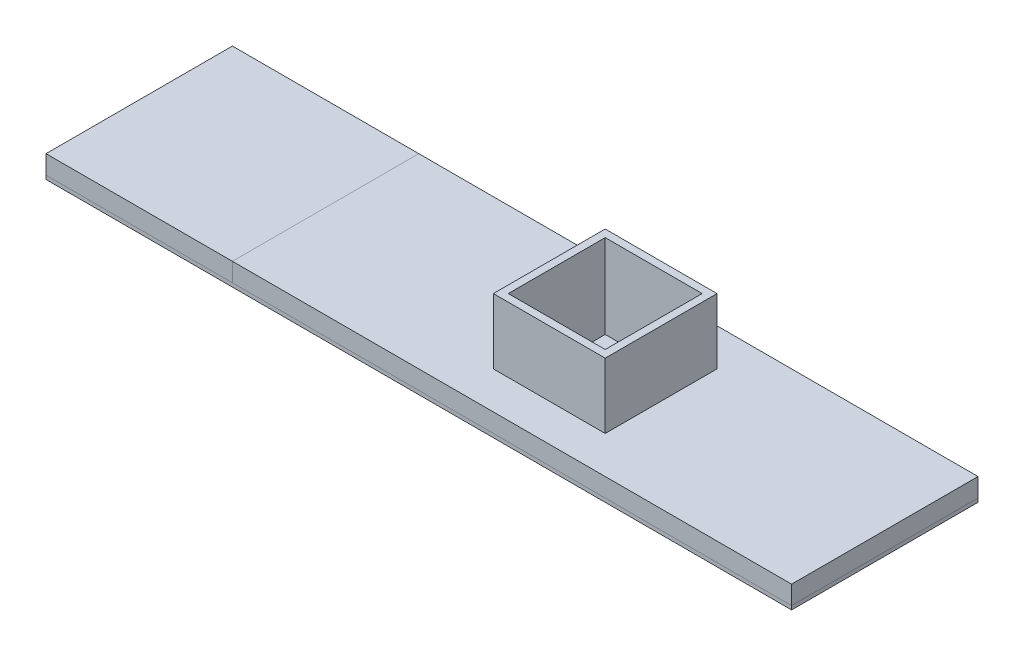
ISO-10303-21;
HEADER;
FILE_DESCRIPTION(('STEP AP214'),'2;1');
FILE_NAME('part.step','',(''),(''),'','','');
FILE_SCHEMA(('AUTOMOTIVE_DESIGN { 1 0 10303 214 1 1 1 1 }'));
ENDSEC;
DATA;
#1=APPLICATION_CONTEXT('core data for automotive mechanical design processes');
#2=APPLICATION_PROTOCOL_DEFINITION('international standard','automotive_design',2000,#1);
#3=PRODUCT_CONTEXT('',#1,'mechanical');
#4=PRODUCT('Part','Part','',(#3));
#5=PRODUCT_RELATED_PRODUCT_CATEGORY('part','',(#4));
#6=PRODUCT_DEFINITION_FORMATION('','',#4);
#7=PRODUCT_DEFINITION_CONTEXT('part definition',#1,'design');
#8=PRODUCT_DEFINITION('design','',#6,#7);
#9=PRODUCT_DEFINITION_SHAPE('','',#8);
#10=(LENGTH_UNIT() NAMED_UNIT(*) SI_UNIT(.MILLI.,.METRE.));
#11=(NAMED_UNIT(*) PLANE_ANGLE_UNIT() SI_UNIT($,.RADIAN.));
#12=(NAMED_UNIT(*) SI_UNIT($,.STERADIAN.) SOLID_ANGLE_UNIT());
#13=UNCERTAINTY_MEASURE_WITH_UNIT(LENGTH_MEASURE(1.E-05),#10,'distance_accuracy_value','');
#14=(GEOMETRIC_REPRESENTATION_CONTEXT(3) GLOBAL_UNCERTAINTY_ASSIGNED_CONTEXT((#13)) GLOBAL_UNIT_ASSIGNED_CONTEXT((#10,
#11,#12)) REPRESENTATION_CONTEXT('',''));
#15=CARTESIAN_POINT('',(0.,0.,0.));
#16=DIRECTION('',(0.,0.,1.));
#17=DIRECTION('',(1.,0.,0.));
#18=AXIS2_PLACEMENT_3D('',#15,#16,#17);
#19=CARTESIAN_POINT('',(62.5049995001,-1.25,-12.5));
#20=DIRECTION('',(0.,0.,-1.));
#21=DIRECTION('',(-1.,0.,0.));
#22=AXIS2_PLACEMENT_3D('',#19,#20,#21);
#23=PLANE('',#22);
#24=DIRECTION('',(0.,1.,0.));
#25=VECTOR('',#24,1.);
#26=CARTESIAN_POINT('',(37.5,-1.25,-12.5));
#27=LINE('',#26,#25);
#28=CARTESIAN_POINT('',(37.5,-1.75,-12.5));
#29=VERTEX_POINT('',#28);
#30=CARTESIAN_POINT('',(37.5,-1.25,-12.5));
#31=VERTEX_POINT('',#30);
#32=EDGE_CURVE('E60',#29,#31,#27,.T.);
#33=ORIENTED_EDGE('',*,*,#32,.F.);
#34=DIRECTION('',(-1.,0.,0.));
#35=VECTOR('',#34,1.);
#36=CARTESIAN_POINT('',(62.5049995001,-1.75,-12.5));
#37=LINE('',#36,#35);
#38=CARTESIAN_POINT('',(-62.5,-1.75,-12.5));
#39=VERTEX_POINT('',#38);
#40=EDGE_CURVE('E88',#29,#39,#37,.T.);
#41=ORIENTED_EDGE('',*,*,#40,.T.);
#42=DIRECTION('',(0.,-1.,0.));
#43=VECTOR('',#42,1.);
#44=CARTESIAN_POINT('',(-62.5,-1.25,-12.5));
#45=LINE('',#44,#43);
#46=CARTESIAN_POINT('',(-62.5,-1.25,-12.5));
#47=VERTEX_POINT('',#46);
#48=EDGE_CURVE('E92',#47,#39,#45,.T.);
#49=ORIENTED_EDGE('',*,*,#48,.F.);
#50=DIRECTION('',(-1.,0.,0.));
#51=VECTOR('',#50,1.);
#52=CARTESIAN_POINT('',(62.5049995001,-1.25,-12.5));
#53=LINE('',#52,#51);
#54=EDGE_CURVE('E115',#31,#47,#53,.T.);
#55=ORIENTED_EDGE('',*,*,#54,.F.);
#56=EDGE_LOOP('',(#33,#41,#49,#55));
#57=FACE_BOUND('',#56,.T.);
#58=ADVANCED_FACE('F52',(#57),#23,.T.);
#59=CARTESIAN_POINT('',(62.5049995001,-1.25,-12.5));
#60=DIRECTION('',(0.,1.,0.));
#61=DIRECTION('',(0.,0.,1.));
#62=AXIS2_PLACEMENT_3D('',#59,#60,#61);
#63=PLANE('',#62);
#64=DIRECTION('',(0.,0.,1.));
#65=VECTOR('',#64,1.);
#66=CARTESIAN_POINT('',(37.5,-1.25,-12.5));
#67=LINE('',#66,#65);
#68=CARTESIAN_POINT('',(37.5,-1.25,12.5));
#69=VERTEX_POINT('',#68);
#70=EDGE_CURVE('E66',#31,#69,#67,.T.);
#71=ORIENTED_EDGE('',*,*,#70,.F.);
#72=ORIENTED_EDGE('',*,*,#54,.T.);
#73=DIRECTION('',(0.,0.,-1.));
#74=VECTOR('',#73,1.);
#75=CARTESIAN_POINT('',(-62.5,-1.25,-12.5));
#76=LINE('',#75,#74);
#77=CARTESIAN_POINT('',(-62.5,-1.25,12.5));
#78=VERTEX_POINT('',#77);
#79=EDGE_CURVE('E97',#78,#47,#76,.T.);
#80=ORIENTED_EDGE('',*,*,#79,.F.);
#81=DIRECTION('',(-1.,0.,0.));
#82=VECTOR('',#81,1.);
#83=CARTESIAN_POINT('',(62.5049995001,-1.25,12.5));
#84=LINE('',#83,#82);
#85=EDGE_CURVE('E118',#69,#78,#84,.T.);
#86=ORIENTED_EDGE('',*,*,#85,.F.);
#87=EDGE_LOOP('',(#71,#72,#80,#86));
#88=FACE_BOUND('',#87,.T.);
#89=ADVANCED_FACE('F124',(#88),#63,.T.);
#90=CARTESIAN_POINT('',(62.5049995001,-1.25,12.5));
#91=DIRECTION('',(0.,0.,1.));
#92=DIRECTION('',(1.,0.,0.));
#93=AXIS2_PLACEMENT_3D('',#90,#91,#92);
#94=PLANE('',#93);
#95=DIRECTION('',(0.,-1.,0.));
#96=VECTOR('',#95,1.);
#97=CARTESIAN_POINT('',(37.5,-1.25,12.5));
#98=LINE('',#97,#96);
#99=CARTESIAN_POINT('',(37.5,-1.75,12.5));
#100=VERTEX_POINT('',#99);
#101=EDGE_CURVE('E117',#69,#100,#98,.T.);
#102=ORIENTED_EDGE('',*,*,#101,.F.);
#103=ORIENTED_EDGE('',*,*,#85,.T.);
#104=DIRECTION('',(0.,1.,0.));
#105=VECTOR('',#104,1.);
#106=CARTESIAN_POINT('',(-62.5,-1.25,12.5));
#107=LINE('',#106,#105);
#108=CARTESIAN_POINT('',(-62.5,-1.75,12.5));
#109=VERTEX_POINT('',#108);
#110=EDGE_CURVE('E105',#109,#78,#107,.T.);
#111=ORIENTED_EDGE('',*,*,#110,.F.);
#112=DIRECTION('',(-1.,0.,0.));
#113=VECTOR('',#112,1.);
#114=CARTESIAN_POINT('',(62.5049995001,-1.75,12.5));
#115=LINE('',#114,#113);
#116=EDGE_CURVE('E96',#100,#109,#115,.T.);
#117=ORIENTED_EDGE('',*,*,#116,.F.);
#118=EDGE_LOOP('',(#102,#103,#111,#117));
#119=FACE_BOUND('',#118,.T.);
#120=ADVANCED_FACE('F122',(#119),#94,.T.);
#121=CARTESIAN_POINT('',(62.5049995001,-1.75,-12.5));
#122=DIRECTION('',(0.,-1.,0.));
#123=DIRECTION('',(0.,0.,-1.));
#124=AXIS2_PLACEMENT_3D('',#121,#122,#123);
#125=PLANE('',#124);
#126=DIRECTION('',(0.,0.,-1.));
#127=VECTOR('',#126,1.);
#128=CARTESIAN_POINT('',(37.5,-1.75,-12.5));
#129=LINE('',#128,#127);
#130=EDGE_CURVE('E12',#100,#29,#129,.T.);
#131=ORIENTED_EDGE('',*,*,#130,.F.);
#132=ORIENTED_EDGE('',*,*,#116,.T.);
#133=DIRECTION('',(0.,0.,1.));
#134=VECTOR('',#133,1.);
#135=CARTESIAN_POINT('',(-62.5,-1.75,-12.5));
#136=LINE('',#135,#134);
#137=EDGE_CURVE('E99',#39,#109,#136,.T.);
#138=ORIENTED_EDGE('',*,*,#137,.F.);
#139=ORIENTED_EDGE('',*,*,#40,.F.);
#140=EDGE_LOOP('',(#131,#132,#138,#139));
#141=FACE_BOUND('',#140,.T.);
#142=ADVANCED_FACE('F100',(#141),#125,.T.);
#143=CARTESIAN_POINT('',(-62.5,0.,0.));
#144=DIRECTION('',(-1.,0.,0.));
#145=DIRECTION('',(0.,0.,1.));
#146=AXIS2_PLACEMENT_3D('',#143,#144,#145);
#147=PLANE('',#146);
#148=ORIENTED_EDGE('',*,*,#48,.T.);
#149=ORIENTED_EDGE('',*,*,#137,.T.);
#150=ORIENTED_EDGE('',*,*,#110,.T.);
#151=ORIENTED_EDGE('',*,*,#79,.T.);
#152=EDGE_LOOP('',(#148,#149,#150,#151));
#153=FACE_BOUND('',#152,.T.);
#154=ADVANCED_FACE('F107',(#153),#147,.T.);
#155=CARTESIAN_POINT('',(37.5,1.25,12.5));
#156=DIRECTION('',(-1.,0.,0.));
#157=DIRECTION('',(0.,0.,1.));
#158=AXIS2_PLACEMENT_3D('',#155,#156,#157);
#159=PLANE('',#158);
#160=ORIENTED_EDGE('',*,*,#32,.T.);
#161=ORIENTED_EDGE('',*,*,#70,.T.);
#162=ORIENTED_EDGE('',*,*,#101,.T.);
#163=ORIENTED_EDGE('',*,*,#130,.T.);
#164=EDGE_LOOP('',(#160,#161,#162,#163));
#165=FACE_BOUND('',#164,.T.);
#166=ADVANCED_FACE('F126',(#165),#159,.F.);
#167=CLOSED_SHELL('',(#58,#89,#120,#142,#154,#166));
#168=MANIFOLD_SOLID_BREP('B2',#167);
#169=CARTESIAN_POINT('',(-37.5,1.25,-12.5));
#170=DIRECTION('',(-1.,0.,0.));
#171=DIRECTION('',(0.,0.,1.));
#172=AXIS2_PLACEMENT_3D('',#169,#170,#171);
#173=PLANE('',#172);
#174=DIRECTION('',(0.,0.,-1.));
#175=VECTOR('',#174,1.);
#176=CARTESIAN_POINT('',(-37.5,-1.25,-12.5));
#177=LINE('',#176,#175);
#178=CARTESIAN_POINT('',(-37.5,-1.25,12.5));
#179=VERTEX_POINT('',#178);
#180=CARTESIAN_POINT('',(-37.5,-1.25,-12.5));
#181=VERTEX_POINT('',#180);
#182=EDGE_CURVE('E249',#179,#181,#177,.T.);
#183=ORIENTED_EDGE('',*,*,#182,.T.);
#184=DIRECTION('',(0.,-1.,0.));
#185=VECTOR('',#184,1.);
#186=CARTESIAN_POINT('',(-37.5,1.25,-12.5));
#187=LINE('',#186,#185);
#188=CARTESIAN_POINT('',(-37.5,1.25,-12.5));
#189=VERTEX_POINT('',#188);
#190=EDGE_CURVE('E50',#189,#181,#187,.T.);
#191=ORIENTED_EDGE('',*,*,#190,.F.);
#192=DIRECTION('',(0.,0.,-1.));
#193=VECTOR('',#192,1.);
#194=CARTESIAN_POINT('',(-37.5,1.25,-12.5));
#195=LINE('',#194,#193);
#196=CARTESIAN_POINT('',(-37.5,1.25,12.5));
#197=VERTEX_POINT('',#196);
#198=EDGE_CURVE('E237',#197,#189,#195,.T.);
#199=ORIENTED_EDGE('',*,*,#198,.F.);
#200=DIRECTION('',(0.,-1.,0.));
#201=VECTOR('',#200,1.);
#202=CARTESIAN_POINT('',(-37.5,1.25,12.5));
#203=LINE('',#202,#201);
#204=EDGE_CURVE('E245',#197,#179,#203,.T.);
#205=ORIENTED_EDGE('',*,*,#204,.T.);
#206=EDGE_LOOP('',(#183,#191,#199,#205));
#207=FACE_BOUND('',#206,.T.);
#208=ADVANCED_FACE('F186',(#207),#173,.F.);
#209=CARTESIAN_POINT('',(-37.5,1.25,-12.5));
#210=DIRECTION('',(0.,0.,1.));
#211=DIRECTION('',(1.,0.,0.));
#212=AXIS2_PLACEMENT_3D('',#209,#210,#211);
#213=PLANE('',#212);
#214=DIRECTION('',(-1.,0.,0.));
#215=VECTOR('',#214,1.);
#216=CARTESIAN_POINT('',(-37.5,-1.25,-12.5));
#217=LINE('',#216,#215);
#218=CARTESIAN_POINT('',(-62.5,-1.25,-12.5));
#219=VERTEX_POINT('',#218);
#220=EDGE_CURVE('E241',#181,#219,#217,.T.);
#221=ORIENTED_EDGE('',*,*,#220,.T.);
#222=DIRECTION('',(0.,-1.,0.));
#223=VECTOR('',#222,1.);
#224=CARTESIAN_POINT('',(-62.5,1.25,-12.5));
#225=LINE('',#224,#223);
#226=CARTESIAN_POINT('',(-62.5,1.25,-12.5));
#227=VERTEX_POINT('',#226);
#228=EDGE_CURVE('E194',#227,#219,#225,.T.);
#229=ORIENTED_EDGE('',*,*,#228,.F.);
#230=DIRECTION('',(-1.,0.,0.));
#231=VECTOR('',#230,1.);
#232=CARTESIAN_POINT('',(-37.5,1.25,-12.5));
#233=LINE('',#232,#231);
#234=EDGE_CURVE('E232',#189,#227,#233,.T.);
#235=ORIENTED_EDGE('',*,*,#234,.F.);
#236=ORIENTED_EDGE('',*,*,#190,.T.);
#237=EDGE_LOOP('',(#221,#229,#235,#236));
#238=FACE_BOUND('',#237,.T.);
#239=ADVANCED_FACE('F240',(#238),#213,.F.);
#240=CARTESIAN_POINT('',(-62.5,1.25,-12.5));
#241=DIRECTION('',(1.,0.,0.));
#242=DIRECTION('',(0.,0.,-1.));
#243=AXIS2_PLACEMENT_3D('',#240,#241,#242);
#244=PLANE('',#243);
#245=DIRECTION('',(0.,0.,1.));
#246=VECTOR('',#245,1.);
#247=CARTESIAN_POINT('',(-62.5,-1.25,-12.5));
#248=LINE('',#247,#246);
#249=CARTESIAN_POINT('',(-62.5,-1.25,12.5));
#250=VERTEX_POINT('',#249);
#251=EDGE_CURVE('E219',#219,#250,#248,.T.);
#252=ORIENTED_EDGE('',*,*,#251,.T.);
#253=DIRECTION('',(0.,-1.,0.));
#254=VECTOR('',#253,1.);
#255=CARTESIAN_POINT('',(-62.5,1.25,12.5));
#256=LINE('',#255,#254);
#257=CARTESIAN_POINT('',(-62.5,1.25,12.5));
#258=VERTEX_POINT('',#257);
#259=EDGE_CURVE('E242',#258,#250,#256,.T.);
#260=ORIENTED_EDGE('',*,*,#259,.F.);
#261=DIRECTION('',(0.,0.,1.));
#262=VECTOR('',#261,1.);
#263=CARTESIAN_POINT('',(-62.5,1.25,-12.5));
#264=LINE('',#263,#262);
#265=EDGE_CURVE('E235',#227,#258,#264,.T.);
#266=ORIENTED_EDGE('',*,*,#265,.F.);
#267=ORIENTED_EDGE('',*,*,#228,.T.);
#268=EDGE_LOOP('',(#252,#260,#266,#267));
#269=FACE_BOUND('',#268,.T.);
#270=ADVANCED_FACE('F243',(#269),#244,.F.);
#271=CARTESIAN_POINT('',(-37.5,1.25,12.5));
#272=DIRECTION('',(0.,0.,-1.));
#273=DIRECTION('',(-1.,0.,0.));
#274=AXIS2_PLACEMENT_3D('',#271,#272,#273);
#275=PLANE('',#274);
#276=DIRECTION('',(1.,0.,0.));
#277=VECTOR('',#276,1.);
#278=CARTESIAN_POINT('',(-37.5,-1.25,12.5));
#279=LINE('',#278,#277);
#280=EDGE_CURVE('E225',#250,#179,#279,.T.);
#281=ORIENTED_EDGE('',*,*,#280,.T.);
#282=ORIENTED_EDGE('',*,*,#204,.F.);
#283=DIRECTION('',(1.,0.,0.));
#284=VECTOR('',#283,1.);
#285=CARTESIAN_POINT('',(-37.5,1.25,12.5));
#286=LINE('',#285,#284);
#287=EDGE_CURVE('E202',#258,#197,#286,.T.);
#288=ORIENTED_EDGE('',*,*,#287,.F.);
#289=ORIENTED_EDGE('',*,*,#259,.T.);
#290=EDGE_LOOP('',(#281,#282,#288,#289));
#291=FACE_BOUND('',#290,.T.);
#292=ADVANCED_FACE('F256',(#291),#275,.F.);
#293=CARTESIAN_POINT('',(0.,1.25,0.));
#294=DIRECTION('',(0.,-1.,0.));
#295=DIRECTION('',(0.,0.,-1.));
#296=AXIS2_PLACEMENT_3D('',#293,#294,#295);
#297=PLANE('',#296);
#298=ORIENTED_EDGE('',*,*,#198,.T.);
#299=ORIENTED_EDGE('',*,*,#234,.T.);
#300=ORIENTED_EDGE('',*,*,#265,.T.);
#301=ORIENTED_EDGE('',*,*,#287,.T.);
#302=EDGE_LOOP('',(#298,#299,#300,#301));
#303=FACE_BOUND('',#302,.T.);
#304=ADVANCED_FACE('F233',(#303),#297,.F.);
#305=CARTESIAN_POINT('',(0.,-1.25,0.));
#306=DIRECTION('',(0.,-1.,0.));
#307=DIRECTION('',(0.,0.,-1.));
#308=AXIS2_PLACEMENT_3D('',#305,#306,#307);
#309=PLANE('',#308);
#310=ORIENTED_EDGE('',*,*,#182,.F.);
#311=ORIENTED_EDGE('',*,*,#280,.F.);
#312=ORIENTED_EDGE('',*,*,#251,.F.);
#313=ORIENTED_EDGE('',*,*,#220,.F.);
#314=EDGE_LOOP('',(#310,#311,#312,#313));
#315=FACE_BOUND('',#314,.T.);
#316=ADVANCED_FACE('F259',(#315),#309,.T.);
#317=CLOSED_SHELL('',(#208,#239,#270,#292,#304,#316));
#318=MANIFOLD_SOLID_BREP('B6',#317);
#319=CARTESIAN_POINT('',(0.,1.25,0.));
#320=DIRECTION('',(0.,-1.,0.));
#321=DIRECTION('',(0.,0.,-1.));
#322=AXIS2_PLACEMENT_3D('',#319,#320,#321);
#323=PLANE('',#322);
#324=DIRECTION('',(0.,0.,-1.));
#325=VECTOR('',#324,1.);
#326=CARTESIAN_POINT('',(37.5,1.25,12.5));
#327=LINE('',#326,#325);
#328=CARTESIAN_POINT('',(37.5,1.25,12.5));
#329=VERTEX_POINT('',#328);
#330=CARTESIAN_POINT('',(37.5,1.25,-12.5));
#331=VERTEX_POINT('',#330);
#332=EDGE_CURVE('E478',#329,#331,#327,.T.);
#333=ORIENTED_EDGE('',*,*,#332,.T.);
#334=DIRECTION('',(-1.,0.,0.));
#335=VECTOR('',#334,1.);
#336=CARTESIAN_POINT('',(-37.5,1.25,-12.5));
#337=LINE('',#336,#335);
#338=CARTESIAN_POINT('',(-37.5,1.25,-12.5));
#339=VERTEX_POINT('',#338);
#340=EDGE_CURVE('E482',#331,#339,#337,.T.);
#341=ORIENTED_EDGE('',*,*,#340,.T.);
#342=DIRECTION('',(0.,0.,1.));
#343=VECTOR('',#342,1.);
#344=CARTESIAN_POINT('',(-37.5,1.25,12.5));
#345=LINE('',#344,#343);
#346=CARTESIAN_POINT('',(-37.5,1.25,12.5));
#347=VERTEX_POINT('',#346);
#348=EDGE_CURVE('E486',#339,#347,#345,.T.);
#349=ORIENTED_EDGE('',*,*,#348,.T.);
#350=DIRECTION('',(1.,0.,0.));
#351=VECTOR('',#350,1.);
#352=CARTESIAN_POINT('',(-37.5,1.25,12.5));
#353=LINE('',#352,#351);
#354=EDGE_CURVE('E489',#347,#329,#353,.T.);
#355=ORIENTED_EDGE('',*,*,#354,.T.);
#356=EDGE_LOOP('',(#333,#341,#349,#355));
#357=FACE_BOUND('',#356,.T.);
#358=DIRECTION('',(0.,0.,-1.));
#359=VECTOR('',#358,1.);
#360=CARTESIAN_POINT('',(7.5,1.25,0.));
#361=LINE('',#360,#359);
#362=CARTESIAN_POINT('',(7.5,1.25,7.5));
#363=VERTEX_POINT('',#362);
#364=CARTESIAN_POINT('',(7.5,1.25,-7.5));
#365=VERTEX_POINT('',#364);
#366=EDGE_CURVE('E184',#363,#365,#361,.T.);
#367=ORIENTED_EDGE('',*,*,#366,.F.);
#368=DIRECTION('',(1.,0.,0.));
#369=VECTOR('',#368,1.);
#370=CARTESIAN_POINT('',(0.,1.25,7.5));
#371=LINE('',#370,#369);
#372=CARTESIAN_POINT('',(-7.5,1.25,7.5));
#373=VERTEX_POINT('',#372);
#374=EDGE_CURVE('E519',#373,#363,#371,.T.);
#375=ORIENTED_EDGE('',*,*,#374,.F.);
#376=DIRECTION('',(0.,0.,1.));
#377=VECTOR('',#376,1.);
#378=CARTESIAN_POINT('',(-7.5,1.25,0.));
#379=LINE('',#378,#377);
#380=CARTESIAN_POINT('',(-7.5,1.25,-7.5));
#381=VERTEX_POINT('',#380);
#382=EDGE_CURVE('E523',#381,#373,#379,.T.);
#383=ORIENTED_EDGE('',*,*,#382,.F.);
#384=DIRECTION('',(-1.,0.,0.));
#385=VECTOR('',#384,1.);
#386=CARTESIAN_POINT('',(0.,1.25,-7.5));
#387=LINE('',#386,#385);
#388=EDGE_CURVE('E319',#365,#381,#387,.T.);
#389=ORIENTED_EDGE('',*,*,#388,.F.);
#390=EDGE_LOOP('',(#367,#375,#383,#389));
#391=FACE_BOUND('',#390,.T.);
#392=ADVANCED_FACE('F310',(#357,#391),#323,.F.);
#393=CARTESIAN_POINT('',(37.5,1.25,12.5));
#394=DIRECTION('',(-1.,0.,0.));
#395=DIRECTION('',(0.,0.,1.));
#396=AXIS2_PLACEMENT_3D('',#393,#394,#395);
#397=PLANE('',#396);
#398=DIRECTION('',(0.,0.,-1.));
#399=VECTOR('',#398,1.);
#400=CARTESIAN_POINT('',(37.5,-1.25,12.5));
#401=LINE('',#400,#399);
#402=CARTESIAN_POINT('',(37.5,-1.25,12.5));
#403=VERTEX_POINT('',#402);
#404=CARTESIAN_POINT('',(37.5,-1.25,-12.5));
#405=VERTEX_POINT('',#404);
#406=EDGE_CURVE('E477',#403,#405,#401,.T.);
#407=ORIENTED_EDGE('',*,*,#406,.T.);
#408=DIRECTION('',(0.,-1.,0.));
#409=VECTOR('',#408,1.);
#410=CARTESIAN_POINT('',(37.5,1.25,-12.5));
#411=LINE('',#410,#409);
#412=EDGE_CURVE('E515',#331,#405,#411,.T.);
#413=ORIENTED_EDGE('',*,*,#412,.F.);
#414=ORIENTED_EDGE('',*,*,#332,.F.);
#415=DIRECTION('',(0.,-1.,0.));
#416=VECTOR('',#415,1.);
#417=CARTESIAN_POINT('',(37.5,1.25,12.5));
#418=LINE('',#417,#416);
#419=EDGE_CURVE('E492',#329,#403,#418,.T.);
#420=ORIENTED_EDGE('',*,*,#419,.T.);
#421=EDGE_LOOP('',(#407,#413,#414,#420));
#422=FACE_BOUND('',#421,.T.);
#423=ADVANCED_FACE('F312',(#422),#397,.F.);
#424=CARTESIAN_POINT('',(-37.5,1.25,-12.5));
#425=DIRECTION('',(0.,0.,1.));
#426=DIRECTION('',(1.,0.,0.));
#427=AXIS2_PLACEMENT_3D('',#424,#425,#426);
#428=PLANE('',#427);
#429=DIRECTION('',(-1.,0.,0.));
#430=VECTOR('',#429,1.);
#431=CARTESIAN_POINT('',(-37.5,-1.25,-12.5));
#432=LINE('',#431,#430);
#433=CARTESIAN_POINT('',(-37.5,-1.25,-12.5));
#434=VERTEX_POINT('',#433);
#435=EDGE_CURVE('E496',#405,#434,#432,.T.);
#436=ORIENTED_EDGE('',*,*,#435,.T.);
#437=DIRECTION('',(0.,-1.,0.));
#438=VECTOR('',#437,1.);
#439=CARTESIAN_POINT('',(-37.5,1.25,-12.5));
#440=LINE('',#439,#438);
#441=EDGE_CURVE('E511',#339,#434,#440,.T.);
#442=ORIENTED_EDGE('',*,*,#441,.F.);
#443=ORIENTED_EDGE('',*,*,#340,.F.);
#444=ORIENTED_EDGE('',*,*,#412,.T.);
#445=EDGE_LOOP('',(#436,#442,#443,#444));
#446=FACE_BOUND('',#445,.T.);
#447=ADVANCED_FACE('F560',(#446),#428,.F.);
#448=CARTESIAN_POINT('',(-37.5,1.25,12.5));
#449=DIRECTION('',(1.,0.,0.));
#450=DIRECTION('',(0.,0.,-1.));
#451=AXIS2_PLACEMENT_3D('',#448,#449,#450);
#452=PLANE('',#451);
#453=DIRECTION('',(0.,0.,1.));
#454=VECTOR('',#453,1.);
#455=CARTESIAN_POINT('',(-37.5,-1.25,12.5));
#456=LINE('',#455,#454);
#457=CARTESIAN_POINT('',(-37.5,-1.25,12.5));
#458=VERTEX_POINT('',#457);
#459=EDGE_CURVE('E499',#434,#458,#456,.T.);
#460=ORIENTED_EDGE('',*,*,#459,.T.);
#461=DIRECTION('',(0.,-1.,0.));
#462=VECTOR('',#461,1.);
#463=CARTESIAN_POINT('',(-37.5,1.25,12.5));
#464=LINE('',#463,#462);
#465=EDGE_CURVE('E507',#347,#458,#464,.T.);
#466=ORIENTED_EDGE('',*,*,#465,.F.);
#467=ORIENTED_EDGE('',*,*,#348,.F.);
#468=ORIENTED_EDGE('',*,*,#441,.T.);
#469=EDGE_LOOP('',(#460,#466,#467,#468));
#470=FACE_BOUND('',#469,.T.);
#471=ADVANCED_FACE('F570',(#470),#452,.F.);
#472=CARTESIAN_POINT('',(-37.5,1.25,12.5));
#473=DIRECTION('',(0.,0.,-1.));
#474=DIRECTION('',(-1.,0.,0.));
#475=AXIS2_PLACEMENT_3D('',#472,#473,#474);
#476=PLANE('',#475);
#477=DIRECTION('',(1.,0.,0.));
#478=VECTOR('',#477,1.);
#479=CARTESIAN_POINT('',(-37.5,-1.25,12.5));
#480=LINE('',#479,#478);
#481=EDGE_CURVE('E483',#458,#403,#480,.T.);
#482=ORIENTED_EDGE('',*,*,#481,.T.);
#483=ORIENTED_EDGE('',*,*,#419,.F.);
#484=ORIENTED_EDGE('',*,*,#354,.F.);
#485=ORIENTED_EDGE('',*,*,#465,.T.);
#486=EDGE_LOOP('',(#482,#483,#484,#485));
#487=FACE_BOUND('',#486,.T.);
#488=ADVANCED_FACE('F567',(#487),#476,.F.);
#489=CARTESIAN_POINT('',(0.,-1.25,0.));
#490=DIRECTION('',(0.,-1.,0.));
#491=DIRECTION('',(0.,0.,-1.));
#492=AXIS2_PLACEMENT_3D('',#489,#490,#491);
#493=PLANE('',#492);
#494=DIRECTION('',(0.,0.,-1.));
#495=VECTOR('',#494,1.);
#496=CARTESIAN_POINT('',(6.5,-1.25,6.5));
#497=LINE('',#496,#495);
#498=CARTESIAN_POINT('',(6.5,-1.25,6.5));
#499=VERTEX_POINT('',#498);
#500=CARTESIAN_POINT('',(6.5,-1.25,-6.5));
#501=VERTEX_POINT('',#500);
#502=EDGE_CURVE('E403',#499,#501,#497,.T.);
#503=ORIENTED_EDGE('',*,*,#502,.T.);
#504=DIRECTION('',(-1.,0.,0.));
#505=VECTOR('',#504,1.);
#506=CARTESIAN_POINT('',(-6.5,-1.25,-6.5));
#507=LINE('',#506,#505);
#508=CARTESIAN_POINT('',(-6.5,-1.25,-6.5));
#509=VERTEX_POINT('',#508);
#510=EDGE_CURVE('E412',#501,#509,#507,.T.);
#511=ORIENTED_EDGE('',*,*,#510,.T.);
#512=DIRECTION('',(0.,0.,1.));
#513=VECTOR('',#512,1.);
#514=CARTESIAN_POINT('',(-6.5,-1.25,6.5));
#515=LINE('',#514,#513);
#516=CARTESIAN_POINT('',(-6.5,-1.25,6.5));
#517=VERTEX_POINT('',#516);
#518=EDGE_CURVE('E425',#509,#517,#515,.T.);
#519=ORIENTED_EDGE('',*,*,#518,.T.);
#520=DIRECTION('',(1.,0.,0.));
#521=VECTOR('',#520,1.);
#522=CARTESIAN_POINT('',(-6.5,-1.25,6.5));
#523=LINE('',#522,#521);
#524=EDGE_CURVE('E421',#517,#499,#523,.T.);
#525=ORIENTED_EDGE('',*,*,#524,.T.);
#526=EDGE_LOOP('',(#503,#511,#519,#525));
#527=FACE_BOUND('',#526,.T.);
#528=ORIENTED_EDGE('',*,*,#406,.F.);
#529=ORIENTED_EDGE('',*,*,#481,.F.);
#530=ORIENTED_EDGE('',*,*,#459,.F.);
#531=ORIENTED_EDGE('',*,*,#435,.F.);
#532=EDGE_LOOP('',(#528,#529,#530,#531));
#533=FACE_BOUND('',#532,.T.);
#534=ADVANCED_FACE('F418',(#527,#533),#493,.T.);
#535=CARTESIAN_POINT('',(7.5,10.,7.5));
#536=DIRECTION('',(-1.,0.,0.));
#537=DIRECTION('',(0.,0.,1.));
#538=AXIS2_PLACEMENT_3D('',#535,#536,#537);
#539=PLANE('',#538);
#540=DIRECTION('',(0.,-1.,0.));
#541=VECTOR('',#540,1.);
#542=CARTESIAN_POINT('',(7.5,10.,7.5));
#543=LINE('',#542,#541);
#544=CARTESIAN_POINT('',(7.5,10.,7.5));
#545=VERTEX_POINT('',#544);
#546=EDGE_CURVE('E461',#545,#363,#543,.T.);
#547=ORIENTED_EDGE('',*,*,#546,.T.);
#548=ORIENTED_EDGE('',*,*,#366,.T.);
#549=DIRECTION('',(0.,-1.,0.));
#550=VECTOR('',#549,1.);
#551=CARTESIAN_POINT('',(7.5,10.,-7.5));
#552=LINE('',#551,#550);
#553=CARTESIAN_POINT('',(7.5,10.,-7.5));
#554=VERTEX_POINT('',#553);
#555=EDGE_CURVE('E473',#554,#365,#552,.T.);
#556=ORIENTED_EDGE('',*,*,#555,.F.);
#557=DIRECTION('',(0.,0.,-1.));
#558=VECTOR('',#557,1.);
#559=CARTESIAN_POINT('',(7.5,10.,7.5));
#560=LINE('',#559,#558);
#561=EDGE_CURVE('E409',#545,#554,#560,.T.);
#562=ORIENTED_EDGE('',*,*,#561,.F.);
#563=EDGE_LOOP('',(#547,#548,#556,#562));
#564=FACE_BOUND('',#563,.T.);
#565=ADVANCED_FACE('F542',(#564),#539,.F.);
#566=CARTESIAN_POINT('',(-7.5,10.,-7.5));
#567=DIRECTION('',(0.,0.,1.));
#568=DIRECTION('',(1.,0.,0.));
#569=AXIS2_PLACEMENT_3D('',#566,#567,#568);
#570=PLANE('',#569);
#571=ORIENTED_EDGE('',*,*,#555,.T.);
#572=ORIENTED_EDGE('',*,*,#388,.T.);
#573=DIRECTION('',(0.,-1.,0.));
#574=VECTOR('',#573,1.);
#575=CARTESIAN_POINT('',(-7.5,10.,-7.5));
#576=LINE('',#575,#574);
#577=CARTESIAN_POINT('',(-7.5,10.,-7.5));
#578=VERTEX_POINT('',#577);
#579=EDGE_CURVE('E469',#578,#381,#576,.T.);
#580=ORIENTED_EDGE('',*,*,#579,.F.);
#581=DIRECTION('',(-1.,0.,0.));
#582=VECTOR('',#581,1.);
#583=CARTESIAN_POINT('',(-7.5,10.,-7.5));
#584=LINE('',#583,#582);
#585=EDGE_CURVE('E452',#554,#578,#584,.T.);
#586=ORIENTED_EDGE('',*,*,#585,.F.);
#587=EDGE_LOOP('',(#571,#572,#580,#586));
#588=FACE_BOUND('',#587,.T.);
#589=ADVANCED_FACE('F529',(#588),#570,.F.);
#590=CARTESIAN_POINT('',(-7.5,10.,7.5));
#591=DIRECTION('',(1.,0.,0.));
#592=DIRECTION('',(0.,0.,-1.));
#593=AXIS2_PLACEMENT_3D('',#590,#591,#592);
#594=PLANE('',#593);
#595=ORIENTED_EDGE('',*,*,#579,.T.);
#596=ORIENTED_EDGE('',*,*,#382,.T.);
#597=DIRECTION('',(0.,-1.,0.));
#598=VECTOR('',#597,1.);
#599=CARTESIAN_POINT('',(-7.5,10.,7.5));
#600=LINE('',#599,#598);
#601=CARTESIAN_POINT('',(-7.5,10.,7.5));
#602=VERTEX_POINT('',#601);
#603=EDGE_CURVE('E465',#602,#373,#600,.T.);
#604=ORIENTED_EDGE('',*,*,#603,.F.);
#605=DIRECTION('',(0.,0.,1.));
#606=VECTOR('',#605,1.);
#607=CARTESIAN_POINT('',(-7.5,10.,7.5));
#608=LINE('',#607,#606);
#609=EDGE_CURVE('E455',#578,#602,#608,.T.);
#610=ORIENTED_EDGE('',*,*,#609,.F.);
#611=EDGE_LOOP('',(#595,#596,#604,#610));
#612=FACE_BOUND('',#611,.T.);
#613=ADVANCED_FACE('F533',(#612),#594,.F.);
#614=CARTESIAN_POINT('',(-7.5,10.,7.5));
#615=DIRECTION('',(0.,0.,-1.));
#616=DIRECTION('',(-1.,0.,0.));
#617=AXIS2_PLACEMENT_3D('',#614,#615,#616);
#618=PLANE('',#617);
#619=ORIENTED_EDGE('',*,*,#603,.T.);
#620=ORIENTED_EDGE('',*,*,#374,.T.);
#621=ORIENTED_EDGE('',*,*,#546,.F.);
#622=DIRECTION('',(1.,0.,0.));
#623=VECTOR('',#622,1.);
#624=CARTESIAN_POINT('',(-7.5,10.,7.5));
#625=LINE('',#624,#623);
#626=EDGE_CURVE('E458',#602,#545,#625,.T.);
#627=ORIENTED_EDGE('',*,*,#626,.F.);
#628=EDGE_LOOP('',(#619,#620,#621,#627));
#629=FACE_BOUND('',#628,.T.);
#630=ADVANCED_FACE('F544',(#629),#618,.F.);
#631=CARTESIAN_POINT('',(6.5,10.,6.5));
#632=DIRECTION('',(-1.,0.,0.));
#633=DIRECTION('',(0.,0.,1.));
#634=AXIS2_PLACEMENT_3D('',#631,#632,#633);
#635=PLANE('',#634);
#636=DIRECTION('',(0.,-1.,0.));
#637=VECTOR('',#636,1.);
#638=CARTESIAN_POINT('',(6.5,10.,-6.5));
#639=LINE('',#638,#637);
#640=CARTESIAN_POINT('',(6.5,10.,-6.5));
#641=VERTEX_POINT('',#640);
#642=EDGE_CURVE('E399',#641,#501,#639,.T.);
#643=ORIENTED_EDGE('',*,*,#642,.T.);
#644=ORIENTED_EDGE('',*,*,#502,.F.);
#645=DIRECTION('',(0.,-1.,0.));
#646=VECTOR('',#645,1.);
#647=CARTESIAN_POINT('',(6.5,10.,6.5));
#648=LINE('',#647,#646);
#649=CARTESIAN_POINT('',(6.5,10.,6.5));
#650=VERTEX_POINT('',#649);
#651=EDGE_CURVE('E441',#650,#499,#648,.T.);
#652=ORIENTED_EDGE('',*,*,#651,.F.);
#653=DIRECTION('',(0.,0.,-1.));
#654=VECTOR('',#653,1.);
#655=CARTESIAN_POINT('',(6.5,10.,6.5));
#656=LINE('',#655,#654);
#657=EDGE_CURVE('E406',#650,#641,#656,.T.);
#658=ORIENTED_EDGE('',*,*,#657,.T.);
#659=EDGE_LOOP('',(#643,#644,#652,#658));
#660=FACE_BOUND('',#659,.T.);
#661=ADVANCED_FACE('F400',(#660),#635,.T.);
#662=CARTESIAN_POINT('',(-6.5,10.,-6.5));
#663=DIRECTION('',(0.,0.,1.));
#664=DIRECTION('',(1.,0.,0.));
#665=AXIS2_PLACEMENT_3D('',#662,#663,#664);
#666=PLANE('',#665);
#667=DIRECTION('',(0.,-1.,0.));
#668=VECTOR('',#667,1.);
#669=CARTESIAN_POINT('',(-6.5,10.,-6.5));
#670=LINE('',#669,#668);
#671=CARTESIAN_POINT('',(-6.5,10.,-6.5));
#672=VERTEX_POINT('',#671);
#673=EDGE_CURVE('E326',#672,#509,#670,.T.);
#674=ORIENTED_EDGE('',*,*,#673,.T.);
#675=ORIENTED_EDGE('',*,*,#510,.F.);
#676=ORIENTED_EDGE('',*,*,#642,.F.);
#677=DIRECTION('',(-1.,0.,0.));
#678=VECTOR('',#677,1.);
#679=CARTESIAN_POINT('',(-6.5,10.,-6.5));
#680=LINE('',#679,#678);
#681=EDGE_CURVE('E431',#641,#672,#680,.T.);
#682=ORIENTED_EDGE('',*,*,#681,.T.);
#683=EDGE_LOOP('',(#674,#675,#676,#682));
#684=FACE_BOUND('',#683,.T.);
#685=ADVANCED_FACE('F413',(#684),#666,.T.);
#686=CARTESIAN_POINT('',(-6.5,10.,6.5));
#687=DIRECTION('',(1.,0.,0.));
#688=DIRECTION('',(0.,0.,-1.));
#689=AXIS2_PLACEMENT_3D('',#686,#687,#688);
#690=PLANE('',#689);
#691=DIRECTION('',(0.,-1.,0.));
#692=VECTOR('',#691,1.);
#693=CARTESIAN_POINT('',(-6.5,10.,6.5));
#694=LINE('',#693,#692);
#695=CARTESIAN_POINT('',(-6.5,10.,6.5));
#696=VERTEX_POINT('',#695);
#697=EDGE_CURVE('E444',#696,#517,#694,.T.);
#698=ORIENTED_EDGE('',*,*,#697,.T.);
#699=ORIENTED_EDGE('',*,*,#518,.F.);
#700=ORIENTED_EDGE('',*,*,#673,.F.);
#701=DIRECTION('',(0.,0.,1.));
#702=VECTOR('',#701,1.);
#703=CARTESIAN_POINT('',(-6.5,10.,6.5));
#704=LINE('',#703,#702);
#705=EDGE_CURVE('E434',#672,#696,#704,.T.);
#706=ORIENTED_EDGE('',*,*,#705,.T.);
#707=EDGE_LOOP('',(#698,#699,#700,#706));
#708=FACE_BOUND('',#707,.T.);
#709=ADVANCED_FACE('F641',(#708),#690,.T.);
#710=CARTESIAN_POINT('',(-6.5,10.,6.5));
#711=DIRECTION('',(0.,0.,-1.));
#712=DIRECTION('',(-1.,0.,0.));
#713=AXIS2_PLACEMENT_3D('',#710,#711,#712);
#714=PLANE('',#713);
#715=ORIENTED_EDGE('',*,*,#651,.T.);
#716=ORIENTED_EDGE('',*,*,#524,.F.);
#717=ORIENTED_EDGE('',*,*,#697,.F.);
#718=DIRECTION('',(1.,0.,0.));
#719=VECTOR('',#718,1.);
#720=CARTESIAN_POINT('',(-6.5,10.,6.5));
#721=LINE('',#720,#719);
#722=EDGE_CURVE('E438',#696,#650,#721,.T.);
#723=ORIENTED_EDGE('',*,*,#722,.T.);
#724=EDGE_LOOP('',(#715,#716,#717,#723));
#725=FACE_BOUND('',#724,.T.);
#726=ADVANCED_FACE('F631',(#725),#714,.T.);
#727=CARTESIAN_POINT('',(0.,10.,0.));
#728=DIRECTION('',(0.,-1.,0.));
#729=DIRECTION('',(0.,0.,-1.));
#730=AXIS2_PLACEMENT_3D('',#727,#728,#729);
#731=PLANE('',#730);
#732=ORIENTED_EDGE('',*,*,#561,.T.);
#733=ORIENTED_EDGE('',*,*,#585,.T.);
#734=ORIENTED_EDGE('',*,*,#609,.T.);
#735=ORIENTED_EDGE('',*,*,#626,.T.);
#736=EDGE_LOOP('',(#732,#733,#734,#735));
#737=FACE_BOUND('',#736,.T.);
#738=ORIENTED_EDGE('',*,*,#657,.F.);
#739=ORIENTED_EDGE('',*,*,#722,.F.);
#740=ORIENTED_EDGE('',*,*,#705,.F.);
#741=ORIENTED_EDGE('',*,*,#681,.F.);
#742=EDGE_LOOP('',(#738,#739,#740,#741));
#743=FACE_BOUND('',#742,.T.);
#744=ADVANCED_FACE('F537',(#737,#743),#731,.F.);
#745=CLOSED_SHELL('',(#392,#423,#447,#471,#488,#534,#565,#589,#613,#630,#661,#685,#709,#726,#744));
#746=MANIFOLD_SOLID_BREP('B44',#745);
#747=ADVANCED_BREP_SHAPE_REPRESENTATION('',(#18,#168,#318,#746),#14);
#748=SHAPE_DEFINITION_REPRESENTATION(#9,#747);
ENDSEC;
END-ISO-10303-21;
